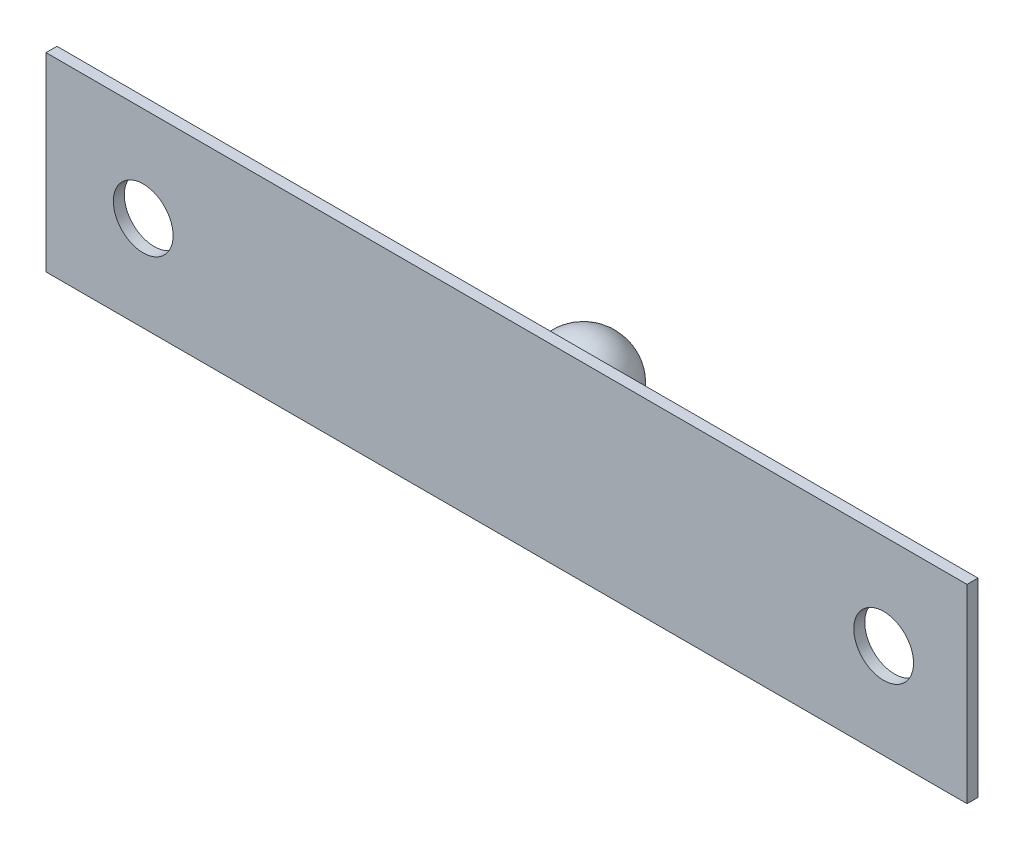
ISO-10303-21;
HEADER;
FILE_DESCRIPTION(('STEP AP214'),'2;1');
FILE_NAME('part.step','',(''),(''),'','','');
FILE_SCHEMA(('AUTOMOTIVE_DESIGN { 1 0 10303 214 1 1 1 1 }'));
ENDSEC;
DATA;
#1=APPLICATION_CONTEXT('core data for automotive mechanical design processes');
#2=APPLICATION_PROTOCOL_DEFINITION('international standard','automotive_design',2000,#1);
#3=PRODUCT_CONTEXT('',#1,'mechanical');
#4=PRODUCT('Part','Part','',(#3));
#5=PRODUCT_RELATED_PRODUCT_CATEGORY('part','',(#4));
#6=PRODUCT_DEFINITION_FORMATION('','',#4);
#7=PRODUCT_DEFINITION_CONTEXT('part definition',#1,'design');
#8=PRODUCT_DEFINITION('design','',#6,#7);
#9=PRODUCT_DEFINITION_SHAPE('','',#8);
#10=(LENGTH_UNIT() NAMED_UNIT(*) SI_UNIT(.MILLI.,.METRE.));
#11=(NAMED_UNIT(*) PLANE_ANGLE_UNIT() SI_UNIT($,.RADIAN.));
#12=(NAMED_UNIT(*) SI_UNIT($,.STERADIAN.) SOLID_ANGLE_UNIT());
#13=UNCERTAINTY_MEASURE_WITH_UNIT(LENGTH_MEASURE(1.E-05),#10,'distance_accuracy_value','');
#14=(GEOMETRIC_REPRESENTATION_CONTEXT(3) GLOBAL_UNCERTAINTY_ASSIGNED_CONTEXT((#13)) GLOBAL_UNIT_ASSIGNED_CONTEXT((#10,
#11,#12)) REPRESENTATION_CONTEXT('',''));
#15=CARTESIAN_POINT('',(0.,0.,0.));
#16=DIRECTION('',(0.,0.,1.));
#17=DIRECTION('',(1.,0.,0.));
#18=AXIS2_PLACEMENT_3D('',#15,#16,#17);
#19=CARTESIAN_POINT('',(0.,0.,0.44));
#20=DIRECTION('',(0.,0.,-1.));
#21=DIRECTION('',(-1.,0.,0.));
#22=AXIS2_PLACEMENT_3D('',#19,#20,#21);
#23=PLANE('',#22);
#24=DIRECTION('',(0.,1.,0.));
#25=VECTOR('',#24,1.);
#26=CARTESIAN_POINT('',(18.5,-3.815,0.44));
#27=LINE('',#26,#25);
#28=CARTESIAN_POINT('',(18.5,-3.815,0.44));
#29=VERTEX_POINT('',#28);
#30=CARTESIAN_POINT('',(18.5,3.815,0.44));
#31=VERTEX_POINT('',#30);
#32=EDGE_CURVE('E96',#29,#31,#27,.T.);
#33=ORIENTED_EDGE('',*,*,#32,.T.);
#34=DIRECTION('',(-1.,0.,0.));
#35=VECTOR('',#34,1.);
#36=CARTESIAN_POINT('',(-18.5,3.815,0.44));
#37=LINE('',#36,#35);
#38=CARTESIAN_POINT('',(-18.5,3.815,0.44));
#39=VERTEX_POINT('',#38);
#40=EDGE_CURVE('E91',#31,#39,#37,.T.);
#41=ORIENTED_EDGE('',*,*,#40,.T.);
#42=DIRECTION('',(0.,-1.,0.));
#43=VECTOR('',#42,1.);
#44=CARTESIAN_POINT('',(-18.5,-3.815,0.44));
#45=LINE('',#44,#43);
#46=CARTESIAN_POINT('',(-18.5,-3.815,0.44));
#47=VERTEX_POINT('',#46);
#48=EDGE_CURVE('E94',#39,#47,#45,.T.);
#49=ORIENTED_EDGE('',*,*,#48,.T.);
#50=DIRECTION('',(1.,0.,0.));
#51=VECTOR('',#50,1.);
#52=CARTESIAN_POINT('',(-18.5,-3.815,0.44));
#53=LINE('',#52,#51);
#54=EDGE_CURVE('E61',#47,#29,#53,.T.);
#55=ORIENTED_EDGE('',*,*,#54,.T.);
#56=EDGE_LOOP('',(#33,#41,#49,#55));
#57=FACE_BOUND('',#56,.T.);
#58=CARTESIAN_POINT('',(-14.5941080196399,0.,0.44));
#59=DIRECTION('',(0.,0.,1.));
#60=DIRECTION('',(1.,0.,0.));
#61=AXIS2_PLACEMENT_3D('',#58,#59,#60);
#62=CIRCLE('',#61,1.2);
#63=CARTESIAN_POINT('',(-13.3941080196399,0.,0.44));
#64=VERTEX_POINT('',#63);
#65=EDGE_CURVE('E116',#64,#64,#62,.T.);
#66=ORIENTED_EDGE('',*,*,#65,.F.);
#67=EDGE_LOOP('',(#66));
#68=FACE_BOUND('',#67,.T.);
#69=CARTESIAN_POINT('',(15.15,0.,0.44));
#70=DIRECTION('',(0.,0.,1.));
#71=DIRECTION('',(1.,0.,0.));
#72=AXIS2_PLACEMENT_3D('',#69,#70,#71);
#73=CIRCLE('',#72,1.2);
#74=CARTESIAN_POINT('',(16.35,0.,0.44));
#75=VERTEX_POINT('',#74);
#76=EDGE_CURVE('E138',#75,#75,#73,.T.);
#77=ORIENTED_EDGE('',*,*,#76,.F.);
#78=EDGE_LOOP('',(#77));
#79=FACE_BOUND('',#78,.T.);
#80=ADVANCED_FACE('F43',(#57,#68,#79),#23,.F.);
#81=CARTESIAN_POINT('',(0.,0.,0.));
#82=DIRECTION('',(0.,0.,-1.));
#83=DIRECTION('',(-1.,0.,0.));
#84=AXIS2_PLACEMENT_3D('',#81,#82,#83);
#85=PLANE('',#84);
#86=CARTESIAN_POINT('',(0.,0.,0.));
#87=DIRECTION('',(0.,0.,1.));
#88=DIRECTION('',(1.,0.,0.));
#89=AXIS2_PLACEMENT_3D('',#86,#87,#88);
#90=CIRCLE('',#89,1.525);
#91=CARTESIAN_POINT('',(1.525,0.,0.));
#92=VERTEX_POINT('',#91);
#93=EDGE_CURVE('E153',#92,#92,#90,.T.);
#94=ORIENTED_EDGE('',*,*,#93,.T.);
#95=EDGE_LOOP('',(#94));
#96=FACE_BOUND('',#95,.T.);
#97=CARTESIAN_POINT('',(-14.5941080196399,0.,0.));
#98=DIRECTION('',(0.,0.,1.));
#99=DIRECTION('',(1.,0.,0.));
#100=AXIS2_PLACEMENT_3D('',#97,#98,#99);
#101=CIRCLE('',#100,1.2);
#102=CARTESIAN_POINT('',(-13.3941080196399,0.,0.));
#103=VERTEX_POINT('',#102);
#104=EDGE_CURVE('E134',#103,#103,#101,.T.);
#105=ORIENTED_EDGE('',*,*,#104,.T.);
#106=EDGE_LOOP('',(#105));
#107=FACE_BOUND('',#106,.T.);
#108=DIRECTION('',(0.,1.,0.));
#109=VECTOR('',#108,1.);
#110=CARTESIAN_POINT('',(18.5,-3.815,0.));
#111=LINE('',#110,#109);
#112=CARTESIAN_POINT('',(18.5,-3.815,0.));
#113=VERTEX_POINT('',#112);
#114=CARTESIAN_POINT('',(18.5,3.815,0.));
#115=VERTEX_POINT('',#114);
#116=EDGE_CURVE('E112',#113,#115,#111,.T.);
#117=ORIENTED_EDGE('',*,*,#116,.F.);
#118=DIRECTION('',(1.,0.,0.));
#119=VECTOR('',#118,1.);
#120=CARTESIAN_POINT('',(-18.5,-3.815,0.));
#121=LINE('',#120,#119);
#122=CARTESIAN_POINT('',(-18.5,-3.815,0.));
#123=VERTEX_POINT('',#122);
#124=EDGE_CURVE('E84',#123,#113,#121,.T.);
#125=ORIENTED_EDGE('',*,*,#124,.F.);
#126=DIRECTION('',(0.,-1.,0.));
#127=VECTOR('',#126,1.);
#128=CARTESIAN_POINT('',(-18.5,-3.815,0.));
#129=LINE('',#128,#127);
#130=CARTESIAN_POINT('',(-18.5,3.815,0.));
#131=VERTEX_POINT('',#130);
#132=EDGE_CURVE('E78',#131,#123,#129,.T.);
#133=ORIENTED_EDGE('',*,*,#132,.F.);
#134=DIRECTION('',(-1.,0.,0.));
#135=VECTOR('',#134,1.);
#136=CARTESIAN_POINT('',(-18.5,3.815,0.));
#137=LINE('',#136,#135);
#138=EDGE_CURVE('E101',#115,#131,#137,.T.);
#139=ORIENTED_EDGE('',*,*,#138,.F.);
#140=EDGE_LOOP('',(#117,#125,#133,#139));
#141=FACE_BOUND('',#140,.T.);
#142=CARTESIAN_POINT('',(15.15,0.,0.));
#143=DIRECTION('',(0.,0.,1.));
#144=DIRECTION('',(1.,0.,0.));
#145=AXIS2_PLACEMENT_3D('',#142,#143,#144);
#146=CIRCLE('',#145,1.2);
#147=CARTESIAN_POINT('',(16.35,0.,0.));
#148=VERTEX_POINT('',#147);
#149=EDGE_CURVE('E142',#148,#148,#146,.T.);
#150=ORIENTED_EDGE('',*,*,#149,.T.);
#151=EDGE_LOOP('',(#150));
#152=FACE_BOUND('',#151,.T.);
#153=ADVANCED_FACE('F129',(#96,#107,#141,#152),#85,.T.);
#154=CARTESIAN_POINT('',(18.5,-3.815,0.44));
#155=DIRECTION('',(-1.,0.,0.));
#156=DIRECTION('',(0.,0.,1.));
#157=AXIS2_PLACEMENT_3D('',#154,#155,#156);
#158=PLANE('',#157);
#159=ORIENTED_EDGE('',*,*,#116,.T.);
#160=DIRECTION('',(0.,0.,-1.));
#161=VECTOR('',#160,1.);
#162=CARTESIAN_POINT('',(18.5,3.815,0.44));
#163=LINE('',#162,#161);
#164=EDGE_CURVE('E11',#31,#115,#163,.T.);
#165=ORIENTED_EDGE('',*,*,#164,.F.);
#166=ORIENTED_EDGE('',*,*,#32,.F.);
#167=DIRECTION('',(0.,0.,-1.));
#168=VECTOR('',#167,1.);
#169=CARTESIAN_POINT('',(18.5,-3.815,0.44));
#170=LINE('',#169,#168);
#171=EDGE_CURVE('E108',#29,#113,#170,.T.);
#172=ORIENTED_EDGE('',*,*,#171,.T.);
#173=EDGE_LOOP('',(#159,#165,#166,#172));
#174=FACE_BOUND('',#173,.T.);
#175=ADVANCED_FACE('F45',(#174),#158,.F.);
#176=CARTESIAN_POINT('',(-18.5,3.815,0.44));
#177=DIRECTION('',(0.,-1.,0.));
#178=DIRECTION('',(0.,0.,-1.));
#179=AXIS2_PLACEMENT_3D('',#176,#177,#178);
#180=PLANE('',#179);
#181=ORIENTED_EDGE('',*,*,#138,.T.);
#182=DIRECTION('',(0.,0.,-1.));
#183=VECTOR('',#182,1.);
#184=CARTESIAN_POINT('',(-18.5,3.815,0.44));
#185=LINE('',#184,#183);
#186=EDGE_CURVE('E53',#39,#131,#185,.T.);
#187=ORIENTED_EDGE('',*,*,#186,.F.);
#188=ORIENTED_EDGE('',*,*,#40,.F.);
#189=ORIENTED_EDGE('',*,*,#164,.T.);
#190=EDGE_LOOP('',(#181,#187,#188,#189));
#191=FACE_BOUND('',#190,.T.);
#192=ADVANCED_FACE('F100',(#191),#180,.F.);
#193=CARTESIAN_POINT('',(-18.5,-3.815,0.44));
#194=DIRECTION('',(1.,0.,0.));
#195=DIRECTION('',(0.,0.,-1.));
#196=AXIS2_PLACEMENT_3D('',#193,#194,#195);
#197=PLANE('',#196);
#198=ORIENTED_EDGE('',*,*,#132,.T.);
#199=DIRECTION('',(0.,0.,-1.));
#200=VECTOR('',#199,1.);
#201=CARTESIAN_POINT('',(-18.5,-3.815,0.44));
#202=LINE('',#201,#200);
#203=EDGE_CURVE('E103',#47,#123,#202,.T.);
#204=ORIENTED_EDGE('',*,*,#203,.F.);
#205=ORIENTED_EDGE('',*,*,#48,.F.);
#206=ORIENTED_EDGE('',*,*,#186,.T.);
#207=EDGE_LOOP('',(#198,#204,#205,#206));
#208=FACE_BOUND('',#207,.T.);
#209=ADVANCED_FACE('F104',(#208),#197,.F.);
#210=CARTESIAN_POINT('',(-18.5,-3.815,0.44));
#211=DIRECTION('',(0.,1.,0.));
#212=DIRECTION('',(0.,0.,1.));
#213=AXIS2_PLACEMENT_3D('',#210,#211,#212);
#214=PLANE('',#213);
#215=ORIENTED_EDGE('',*,*,#124,.T.);
#216=ORIENTED_EDGE('',*,*,#171,.F.);
#217=ORIENTED_EDGE('',*,*,#54,.F.);
#218=ORIENTED_EDGE('',*,*,#203,.T.);
#219=EDGE_LOOP('',(#215,#216,#217,#218));
#220=FACE_BOUND('',#219,.T.);
#221=ADVANCED_FACE('F126',(#220),#214,.F.);
#222=CARTESIAN_POINT('',(-14.5941080196399,0.,0.44));
#223=DIRECTION('',(0.,0.,-1.));
#224=DIRECTION('',(-1.,0.,0.));
#225=AXIS2_PLACEMENT_3D('',#222,#223,#224);
#226=CYLINDRICAL_SURFACE('',#225,1.2);
#227=ORIENTED_EDGE('',*,*,#65,.T.);
#228=EDGE_LOOP('',(#227));
#229=FACE_BOUND('',#228,.T.);
#230=ORIENTED_EDGE('',*,*,#104,.F.);
#231=EDGE_LOOP('',(#230));
#232=FACE_BOUND('',#231,.T.);
#233=ADVANCED_FACE('F173',(#229,#232),#226,.F.);
#234=CARTESIAN_POINT('',(15.15,0.,0.44));
#235=DIRECTION('',(0.,0.,-1.));
#236=DIRECTION('',(-1.,0.,0.));
#237=AXIS2_PLACEMENT_3D('',#234,#235,#236);
#238=CYLINDRICAL_SURFACE('',#237,1.2);
#239=ORIENTED_EDGE('',*,*,#76,.T.);
#240=EDGE_LOOP('',(#239));
#241=FACE_BOUND('',#240,.T.);
#242=ORIENTED_EDGE('',*,*,#149,.F.);
#243=EDGE_LOOP('',(#242));
#244=FACE_BOUND('',#243,.T.);
#245=ADVANCED_FACE('F168',(#241,#244),#238,.F.);
#246=CARTESIAN_POINT('',(0.,0.,-2.645));
#247=DIRECTION('',(0.,0.,1.));
#248=DIRECTION('',(-1.,0.,0.));
#249=AXIS2_PLACEMENT_3D('',#246,#247,#248);
#250=SPHERICAL_SURFACE('',#249,1.775);
#251=CARTESIAN_POINT('',(0.,0.,-1.73670489377075));
#252=DIRECTION('',(0.,0.,1.));
#253=DIRECTION('',(1.,0.,0.));
#254=AXIS2_PLACEMENT_3D('',#251,#252,#253);
#255=CIRCLE('',#254,1.525);
#256=CARTESIAN_POINT('',(1.525,0.,-1.73670489377075));
#257=VERTEX_POINT('',#256);
#258=EDGE_CURVE('E146',#257,#257,#255,.T.);
#259=ORIENTED_EDGE('',*,*,#258,.F.);
#260=EDGE_LOOP('',(#259));
#261=FACE_BOUND('',#260,.T.);
#262=ADVANCED_FACE('F163',(#261),#250,.T.);
#263=CARTESIAN_POINT('',(0.,0.,0.));
#264=DIRECTION('',(0.,0.,1.));
#265=DIRECTION('',(1.,0.,0.));
#266=AXIS2_PLACEMENT_3D('',#263,#264,#265);
#267=CYLINDRICAL_SURFACE('',#266,1.525);
#268=ORIENTED_EDGE('',*,*,#93,.F.);
#269=EDGE_LOOP('',(#268));
#270=FACE_BOUND('',#269,.T.);
#271=ORIENTED_EDGE('',*,*,#258,.T.);
#272=EDGE_LOOP('',(#271));
#273=FACE_BOUND('',#272,.T.);
#274=ADVANCED_FACE('F160',(#270,#273),#267,.T.);
#275=CLOSED_SHELL('',(#80,#153,#175,#192,#209,#221,#233,#245,#262,#274));
#276=MANIFOLD_SOLID_BREP('B2',#275);
#277=ADVANCED_BREP_SHAPE_REPRESENTATION('',(#18,#276),#14);
#278=SHAPE_DEFINITION_REPRESENTATION(#9,#277);
ENDSEC;
END-ISO-10303-21;
